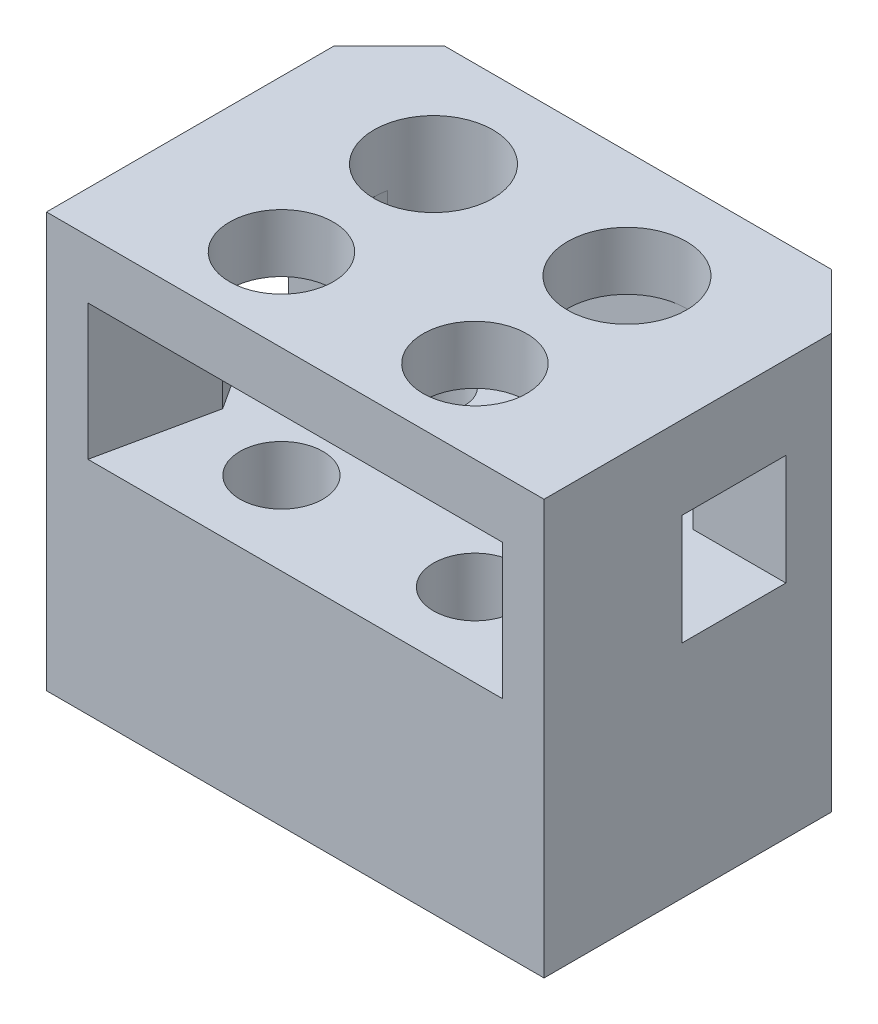
ISO-10303-21;
HEADER;
FILE_DESCRIPTION(('STEP AP214'),'2;1');
FILE_NAME('part.step','',(''),(''),'','','');
FILE_SCHEMA(('AUTOMOTIVE_DESIGN { 1 0 10303 214 1 1 1 1 }'));
ENDSEC;
DATA;
#1=APPLICATION_CONTEXT('core data for automotive mechanical design processes');
#2=APPLICATION_PROTOCOL_DEFINITION('international standard','automotive_design',2000,#1);
#3=PRODUCT_CONTEXT('',#1,'mechanical');
#4=PRODUCT('Part','Part','',(#3));
#5=PRODUCT_RELATED_PRODUCT_CATEGORY('part','',(#4));
#6=PRODUCT_DEFINITION_FORMATION('','',#4);
#7=PRODUCT_DEFINITION_CONTEXT('part definition',#1,'design');
#8=PRODUCT_DEFINITION('design','',#6,#7);
#9=PRODUCT_DEFINITION_SHAPE('','',#8);
#10=(LENGTH_UNIT() NAMED_UNIT(*) SI_UNIT(.MILLI.,.METRE.));
#11=(NAMED_UNIT(*) PLANE_ANGLE_UNIT() SI_UNIT($,.RADIAN.));
#12=(NAMED_UNIT(*) SI_UNIT($,.STERADIAN.) SOLID_ANGLE_UNIT());
#13=UNCERTAINTY_MEASURE_WITH_UNIT(LENGTH_MEASURE(1.E-05),#10,'distance_accuracy_value','');
#14=(GEOMETRIC_REPRESENTATION_CONTEXT(3) GLOBAL_UNCERTAINTY_ASSIGNED_CONTEXT((#13)) GLOBAL_UNIT_ASSIGNED_CONTEXT((#10,
#11,#12)) REPRESENTATION_CONTEXT('',''));
#15=CARTESIAN_POINT('',(0.,0.,0.));
#16=DIRECTION('',(0.,0.,1.));
#17=DIRECTION('',(1.,0.,0.));
#18=AXIS2_PLACEMENT_3D('',#15,#16,#17);
#19=CARTESIAN_POINT('',(-18.,30.,0.));
#20=DIRECTION('',(0.,0.,-1.));
#21=DIRECTION('',(-1.,0.,0.));
#22=AXIS2_PLACEMENT_3D('',#19,#20,#21);
#23=PLANE('',#22);
#24=DIRECTION('',(1.,0.,0.));
#25=VECTOR('',#24,1.);
#26=CARTESIAN_POINT('',(-18.,0.,0.));
#27=LINE('',#26,#25);
#28=CARTESIAN_POINT('',(-18.,0.,0.));
#29=VERTEX_POINT('',#28);
#30=CARTESIAN_POINT('',(18.,0.,0.));
#31=VERTEX_POINT('',#30);
#32=EDGE_CURVE('E416',#29,#31,#27,.T.);
#33=ORIENTED_EDGE('',*,*,#32,.T.);
#34=DIRECTION('',(0.,-1.,0.));
#35=VECTOR('',#34,1.);
#36=CARTESIAN_POINT('',(18.,30.,0.));
#37=LINE('',#36,#35);
#38=CARTESIAN_POINT('',(18.,30.,0.));
#39=VERTEX_POINT('',#38);
#40=EDGE_CURVE('E438',#39,#31,#37,.T.);
#41=ORIENTED_EDGE('',*,*,#40,.F.);
#42=DIRECTION('',(1.,0.,0.));
#43=VECTOR('',#42,1.);
#44=CARTESIAN_POINT('',(-18.,30.,0.));
#45=LINE('',#44,#43);
#46=CARTESIAN_POINT('',(-18.,30.,0.));
#47=VERTEX_POINT('',#46);
#48=EDGE_CURVE('E397',#47,#39,#45,.T.);
#49=ORIENTED_EDGE('',*,*,#48,.F.);
#50=DIRECTION('',(0.,-1.,0.));
#51=VECTOR('',#50,1.);
#52=CARTESIAN_POINT('',(-18.,30.,0.));
#53=LINE('',#52,#51);
#54=EDGE_CURVE('E442',#47,#29,#53,.T.);
#55=ORIENTED_EDGE('',*,*,#54,.T.);
#56=EDGE_LOOP('',(#33,#41,#49,#55));
#57=FACE_BOUND('',#56,.T.);
#58=DIRECTION('',(1.,0.,0.));
#59=VECTOR('',#58,1.);
#60=CARTESIAN_POINT('',(15.,25.8,0.));
#61=LINE('',#60,#59);
#62=CARTESIAN_POINT('',(-15.,25.8,0.));
#63=VERTEX_POINT('',#62);
#64=CARTESIAN_POINT('',(15.,25.8,0.));
#65=VERTEX_POINT('',#64);
#66=EDGE_CURVE('E337',#63,#65,#61,.T.);
#67=ORIENTED_EDGE('',*,*,#66,.T.);
#68=DIRECTION('',(0.,-1.,0.));
#69=VECTOR('',#68,1.);
#70=CARTESIAN_POINT('',(15.,25.8,0.));
#71=LINE('',#70,#69);
#72=CARTESIAN_POINT('',(15.,16.,0.));
#73=VERTEX_POINT('',#72);
#74=EDGE_CURVE('E371',#65,#73,#71,.T.);
#75=ORIENTED_EDGE('',*,*,#74,.T.);
#76=DIRECTION('',(1.,0.,0.));
#77=VECTOR('',#76,1.);
#78=CARTESIAN_POINT('',(15.,16.,0.));
#79=LINE('',#78,#77);
#80=CARTESIAN_POINT('',(-15.,16.,0.));
#81=VERTEX_POINT('',#80);
#82=EDGE_CURVE('E362',#81,#73,#79,.T.);
#83=ORIENTED_EDGE('',*,*,#82,.F.);
#84=DIRECTION('',(0.,-1.,0.));
#85=VECTOR('',#84,1.);
#86=CARTESIAN_POINT('',(-15.,25.8,0.));
#87=LINE('',#86,#85);
#88=EDGE_CURVE('E375',#63,#81,#87,.T.);
#89=ORIENTED_EDGE('',*,*,#88,.F.);
#90=EDGE_LOOP('',(#67,#75,#83,#89));
#91=FACE_BOUND('',#90,.T.);
#92=ADVANCED_FACE('F46',(#57,#91),#23,.F.);
#93=CARTESIAN_POINT('',(-18.,30.,-20.8));
#94=DIRECTION('',(0.707106781186546,0.,0.707106781186549));
#95=DIRECTION('',(0.707106781186549,0.,-0.707106781186546));
#96=AXIS2_PLACEMENT_3D('',#93,#94,#95);
#97=PLANE('',#96);
#98=DIRECTION('',(-0.707106781186548,0.,0.707106781186546));
#99=VECTOR('',#98,1.);
#100=CARTESIAN_POINT('',(-18.,0.,-20.8));
#101=LINE('',#100,#99);
#102=CARTESIAN_POINT('',(-14.,0.,-24.8));
#103=VERTEX_POINT('',#102);
#104=CARTESIAN_POINT('',(-18.,0.,-20.8));
#105=VERTEX_POINT('',#104);
#106=EDGE_CURVE('E388',#103,#105,#101,.T.);
#107=ORIENTED_EDGE('',*,*,#106,.T.);
#108=DIRECTION('',(0.,-1.,0.));
#109=VECTOR('',#108,1.);
#110=CARTESIAN_POINT('',(-18.,30.,-20.8));
#111=LINE('',#110,#109);
#112=CARTESIAN_POINT('',(-18.,30.,-20.8));
#113=VERTEX_POINT('',#112);
#114=EDGE_CURVE('E446',#113,#105,#111,.T.);
#115=ORIENTED_EDGE('',*,*,#114,.F.);
#116=DIRECTION('',(-0.707106781186548,0.,0.707106781186546));
#117=VECTOR('',#116,1.);
#118=CARTESIAN_POINT('',(-18.,30.,-20.8));
#119=LINE('',#118,#117);
#120=CARTESIAN_POINT('',(-14.,30.,-24.8));
#121=VERTEX_POINT('',#120);
#122=EDGE_CURVE('E389',#121,#113,#119,.T.);
#123=ORIENTED_EDGE('',*,*,#122,.F.);
#124=DIRECTION('',(0.,-1.,0.));
#125=VECTOR('',#124,1.);
#126=CARTESIAN_POINT('',(-14.,30.,-24.8));
#127=LINE('',#126,#125);
#128=EDGE_CURVE('E409',#121,#103,#127,.T.);
#129=ORIENTED_EDGE('',*,*,#128,.T.);
#130=EDGE_LOOP('',(#107,#115,#123,#129));
#131=FACE_BOUND('',#130,.T.);
#132=ADVANCED_FACE('F640',(#131),#97,.F.);
#133=CARTESIAN_POINT('',(-18.,30.,0.));
#134=DIRECTION('',(1.,0.,0.));
#135=DIRECTION('',(0.,0.,-1.));
#136=AXIS2_PLACEMENT_3D('',#133,#134,#135);
#137=PLANE('',#136);
#138=DIRECTION('',(0.,0.,1.));
#139=VECTOR('',#138,1.);
#140=CARTESIAN_POINT('',(-18.,24.,-10.));
#141=LINE('',#140,#139);
#142=CARTESIAN_POINT('',(-18.,24.,-17.5));
#143=VERTEX_POINT('',#142);
#144=CARTESIAN_POINT('',(-18.,24.,-10.));
#145=VERTEX_POINT('',#144);
#146=EDGE_CURVE('E273',#143,#145,#141,.T.);
#147=ORIENTED_EDGE('',*,*,#146,.T.);
#148=DIRECTION('',(0.,-1.,0.));
#149=VECTOR('',#148,1.);
#150=CARTESIAN_POINT('',(-18.,24.,-10.));
#151=LINE('',#150,#149);
#152=CARTESIAN_POINT('',(-18.,16.,-10.));
#153=VERTEX_POINT('',#152);
#154=EDGE_CURVE('E258',#145,#153,#151,.T.);
#155=ORIENTED_EDGE('',*,*,#154,.T.);
#156=DIRECTION('',(0.,0.,-1.));
#157=VECTOR('',#156,1.);
#158=CARTESIAN_POINT('',(-18.,16.,-10.));
#159=LINE('',#158,#157);
#160=CARTESIAN_POINT('',(-18.,16.,-17.5));
#161=VERTEX_POINT('',#160);
#162=EDGE_CURVE('E265',#153,#161,#159,.T.);
#163=ORIENTED_EDGE('',*,*,#162,.T.);
#164=DIRECTION('',(0.,1.,0.));
#165=VECTOR('',#164,1.);
#166=CARTESIAN_POINT('',(-18.,24.,-17.5));
#167=LINE('',#166,#165);
#168=EDGE_CURVE('E269',#161,#143,#167,.T.);
#169=ORIENTED_EDGE('',*,*,#168,.T.);
#170=EDGE_LOOP('',(#147,#155,#163,#169));
#171=FACE_BOUND('',#170,.T.);
#172=DIRECTION('',(0.,0.,1.));
#173=VECTOR('',#172,1.);
#174=CARTESIAN_POINT('',(-18.,0.,0.));
#175=LINE('',#174,#173);
#176=EDGE_CURVE('E413',#105,#29,#175,.T.);
#177=ORIENTED_EDGE('',*,*,#176,.T.);
#178=ORIENTED_EDGE('',*,*,#54,.F.);
#179=DIRECTION('',(0.,0.,1.));
#180=VECTOR('',#179,1.);
#181=CARTESIAN_POINT('',(-18.,30.,0.));
#182=LINE('',#181,#180);
#183=EDGE_CURVE('E393',#113,#47,#182,.T.);
#184=ORIENTED_EDGE('',*,*,#183,.F.);
#185=ORIENTED_EDGE('',*,*,#114,.T.);
#186=EDGE_LOOP('',(#177,#178,#184,#185));
#187=FACE_BOUND('',#186,.T.);
#188=ADVANCED_FACE('F607',(#171,#187),#137,.F.);
#189=CARTESIAN_POINT('',(18.,30.,0.));
#190=DIRECTION('',(-1.,0.,0.));
#191=DIRECTION('',(0.,0.,1.));
#192=AXIS2_PLACEMENT_3D('',#189,#190,#191);
#193=PLANE('',#192);
#194=DIRECTION('',(0.,0.,-1.));
#195=VECTOR('',#194,1.);
#196=CARTESIAN_POINT('',(18.,16.,-10.));
#197=LINE('',#196,#195);
#198=CARTESIAN_POINT('',(18.,16.,-10.));
#199=VERTEX_POINT('',#198);
#200=CARTESIAN_POINT('',(18.,16.,-17.5));
#201=VERTEX_POINT('',#200);
#202=EDGE_CURVE('E237',#199,#201,#197,.T.);
#203=ORIENTED_EDGE('',*,*,#202,.F.);
#204=DIRECTION('',(0.,-1.,0.));
#205=VECTOR('',#204,1.);
#206=CARTESIAN_POINT('',(18.,24.,-10.));
#207=LINE('',#206,#205);
#208=CARTESIAN_POINT('',(18.,24.,-10.));
#209=VERTEX_POINT('',#208);
#210=EDGE_CURVE('E247',#209,#199,#207,.T.);
#211=ORIENTED_EDGE('',*,*,#210,.F.);
#212=DIRECTION('',(0.,0.,1.));
#213=VECTOR('',#212,1.);
#214=CARTESIAN_POINT('',(18.,24.,-10.));
#215=LINE('',#214,#213);
#216=CARTESIAN_POINT('',(18.,24.,-17.5));
#217=VERTEX_POINT('',#216);
#218=EDGE_CURVE('E252',#217,#209,#215,.T.);
#219=ORIENTED_EDGE('',*,*,#218,.F.);
#220=DIRECTION('',(0.,1.,0.));
#221=VECTOR('',#220,1.);
#222=CARTESIAN_POINT('',(18.,24.,-17.5));
#223=LINE('',#222,#221);
#224=EDGE_CURVE('E227',#201,#217,#223,.T.);
#225=ORIENTED_EDGE('',*,*,#224,.F.);
#226=EDGE_LOOP('',(#203,#211,#219,#225));
#227=FACE_BOUND('',#226,.T.);
#228=DIRECTION('',(0.,0.,-1.));
#229=VECTOR('',#228,1.);
#230=CARTESIAN_POINT('',(18.,0.,0.));
#231=LINE('',#230,#229);
#232=CARTESIAN_POINT('',(18.,0.,-20.8));
#233=VERTEX_POINT('',#232);
#234=EDGE_CURVE('E419',#31,#233,#231,.T.);
#235=ORIENTED_EDGE('',*,*,#234,.T.);
#236=DIRECTION('',(0.,-1.,0.));
#237=VECTOR('',#236,1.);
#238=CARTESIAN_POINT('',(18.,30.,-20.8));
#239=LINE('',#238,#237);
#240=CARTESIAN_POINT('',(18.,30.,-20.8));
#241=VERTEX_POINT('',#240);
#242=EDGE_CURVE('E434',#241,#233,#239,.T.);
#243=ORIENTED_EDGE('',*,*,#242,.F.);
#244=DIRECTION('',(0.,0.,-1.));
#245=VECTOR('',#244,1.);
#246=CARTESIAN_POINT('',(18.,30.,0.));
#247=LINE('',#246,#245);
#248=EDGE_CURVE('E400',#39,#241,#247,.T.);
#249=ORIENTED_EDGE('',*,*,#248,.F.);
#250=ORIENTED_EDGE('',*,*,#40,.T.);
#251=EDGE_LOOP('',(#235,#243,#249,#250));
#252=FACE_BOUND('',#251,.T.);
#253=ADVANCED_FACE('F249',(#227,#252),#193,.F.);
#254=CARTESIAN_POINT('',(18.,30.,-20.8));
#255=DIRECTION('',(-0.707106781186546,0.,0.707106781186549));
#256=DIRECTION('',(0.707106781186549,0.,0.707106781186546));
#257=AXIS2_PLACEMENT_3D('',#254,#255,#256);
#258=PLANE('',#257);
#259=DIRECTION('',(-0.707106781186548,0.,-0.707106781186546));
#260=VECTOR('',#259,1.);
#261=CARTESIAN_POINT('',(18.,0.,-20.8));
#262=LINE('',#261,#260);
#263=CARTESIAN_POINT('',(14.,0.,-24.8));
#264=VERTEX_POINT('',#263);
#265=EDGE_CURVE('E422',#233,#264,#262,.T.);
#266=ORIENTED_EDGE('',*,*,#265,.T.);
#267=DIRECTION('',(0.,-1.,0.));
#268=VECTOR('',#267,1.);
#269=CARTESIAN_POINT('',(14.,30.,-24.8));
#270=LINE('',#269,#268);
#271=CARTESIAN_POINT('',(14.,30.,-24.8));
#272=VERTEX_POINT('',#271);
#273=EDGE_CURVE('E430',#272,#264,#270,.T.);
#274=ORIENTED_EDGE('',*,*,#273,.F.);
#275=DIRECTION('',(-0.707106781186548,0.,-0.707106781186546));
#276=VECTOR('',#275,1.);
#277=CARTESIAN_POINT('',(18.,30.,-20.8));
#278=LINE('',#277,#276);
#279=EDGE_CURVE('E403',#241,#272,#278,.T.);
#280=ORIENTED_EDGE('',*,*,#279,.F.);
#281=ORIENTED_EDGE('',*,*,#242,.T.);
#282=EDGE_LOOP('',(#266,#274,#280,#281));
#283=FACE_BOUND('',#282,.T.);
#284=ADVANCED_FACE('F716',(#283),#258,.F.);
#285=CARTESIAN_POINT('',(14.,30.,-24.8));
#286=DIRECTION('',(0.,0.,1.));
#287=DIRECTION('',(1.,0.,0.));
#288=AXIS2_PLACEMENT_3D('',#285,#286,#287);
#289=PLANE('',#288);
#290=DIRECTION('',(-1.,0.,0.));
#291=VECTOR('',#290,1.);
#292=CARTESIAN_POINT('',(14.,0.,-24.8));
#293=LINE('',#292,#291);
#294=EDGE_CURVE('E394',#264,#103,#293,.T.);
#295=ORIENTED_EDGE('',*,*,#294,.T.);
#296=ORIENTED_EDGE('',*,*,#128,.F.);
#297=DIRECTION('',(-1.,0.,0.));
#298=VECTOR('',#297,1.);
#299=CARTESIAN_POINT('',(14.,30.,-24.8));
#300=LINE('',#299,#298);
#301=EDGE_CURVE('E406',#272,#121,#300,.T.);
#302=ORIENTED_EDGE('',*,*,#301,.F.);
#303=ORIENTED_EDGE('',*,*,#273,.T.);
#304=EDGE_LOOP('',(#295,#296,#302,#303));
#305=FACE_BOUND('',#304,.T.);
#306=ADVANCED_FACE('F712',(#305),#289,.F.);
#307=CARTESIAN_POINT('',(0.,30.,0.));
#308=DIRECTION('',(0.,1.,0.));
#309=DIRECTION('',(0.,0.,1.));
#310=AXIS2_PLACEMENT_3D('',#307,#308,#309);
#311=PLANE('',#310);
#312=CARTESIAN_POINT('',(-7.,30.,-6.));
#313=DIRECTION('',(0.,1.,0.));
#314=DIRECTION('',(0.,0.,1.));
#315=AXIS2_PLACEMENT_3D('',#312,#313,#314);
#316=CIRCLE('',#315,3.74999999999999);
#317=CARTESIAN_POINT('',(-7.,30.,-2.25000000000001));
#318=VERTEX_POINT('',#317);
#319=EDGE_CURVE('E535',#318,#318,#316,.T.);
#320=ORIENTED_EDGE('',*,*,#319,.F.);
#321=EDGE_LOOP('',(#320));
#322=FACE_BOUND('',#321,.T.);
#323=CARTESIAN_POINT('',(7.,30.,-6.));
#324=DIRECTION('',(0.,1.,0.));
#325=DIRECTION('',(0.,0.,1.));
#326=AXIS2_PLACEMENT_3D('',#323,#324,#325);
#327=CIRCLE('',#326,3.74999999999999);
#328=CARTESIAN_POINT('',(7.,30.,-2.25000000000001));
#329=VERTEX_POINT('',#328);
#330=EDGE_CURVE('E534',#329,#329,#327,.T.);
#331=ORIENTED_EDGE('',*,*,#330,.F.);
#332=EDGE_LOOP('',(#331));
#333=FACE_BOUND('',#332,.T.);
#334=CARTESIAN_POINT('',(-7.,30.,-17.));
#335=DIRECTION('',(0.,1.,0.));
#336=DIRECTION('',(0.,0.,1.));
#337=AXIS2_PLACEMENT_3D('',#334,#335,#336);
#338=CIRCLE('',#337,4.3);
#339=CARTESIAN_POINT('',(-7.,30.,-12.7));
#340=VERTEX_POINT('',#339);
#341=EDGE_CURVE('E309',#340,#340,#338,.T.);
#342=ORIENTED_EDGE('',*,*,#341,.F.);
#343=EDGE_LOOP('',(#342));
#344=FACE_BOUND('',#343,.T.);
#345=CARTESIAN_POINT('',(7.,30.,-17.));
#346=DIRECTION('',(0.,1.,0.));
#347=DIRECTION('',(0.,0.,1.));
#348=AXIS2_PLACEMENT_3D('',#345,#346,#347);
#349=CIRCLE('',#348,4.3);
#350=CARTESIAN_POINT('',(7.,30.,-12.7));
#351=VERTEX_POINT('',#350);
#352=EDGE_CURVE('E320',#351,#351,#349,.T.);
#353=ORIENTED_EDGE('',*,*,#352,.F.);
#354=EDGE_LOOP('',(#353));
#355=FACE_BOUND('',#354,.T.);
#356=ORIENTED_EDGE('',*,*,#122,.T.);
#357=ORIENTED_EDGE('',*,*,#183,.T.);
#358=ORIENTED_EDGE('',*,*,#48,.T.);
#359=ORIENTED_EDGE('',*,*,#248,.T.);
#360=ORIENTED_EDGE('',*,*,#279,.T.);
#361=ORIENTED_EDGE('',*,*,#301,.T.);
#362=EDGE_LOOP('',(#356,#357,#358,#359,#360,#361));
#363=FACE_BOUND('',#362,.T.);
#364=ADVANCED_FACE('F700',(#322,#333,#344,#355,#363),#311,.T.);
#365=CARTESIAN_POINT('',(0.,0.,0.));
#366=DIRECTION('',(0.,1.,0.));
#367=DIRECTION('',(0.,0.,1.));
#368=AXIS2_PLACEMENT_3D('',#365,#366,#367);
#369=PLANE('',#368);
#370=CARTESIAN_POINT('',(-7.,0.,-6.));
#371=DIRECTION('',(0.,1.,0.));
#372=DIRECTION('',(0.,0.,1.));
#373=AXIS2_PLACEMENT_3D('',#370,#371,#372);
#374=CIRCLE('',#373,2.99999999999999);
#375=CARTESIAN_POINT('',(-7.,0.,-3.00000000000001));
#376=VERTEX_POINT('',#375);
#377=EDGE_CURVE('E299',#376,#376,#374,.T.);
#378=ORIENTED_EDGE('',*,*,#377,.T.);
#379=EDGE_LOOP('',(#378));
#380=FACE_BOUND('',#379,.T.);
#381=CARTESIAN_POINT('',(7.,0.,-6.));
#382=DIRECTION('',(0.,1.,0.));
#383=DIRECTION('',(0.,0.,1.));
#384=AXIS2_PLACEMENT_3D('',#381,#382,#383);
#385=CIRCLE('',#384,2.99999999999999);
#386=CARTESIAN_POINT('',(7.,0.,-3.00000000000001));
#387=VERTEX_POINT('',#386);
#388=EDGE_CURVE('E304',#387,#387,#385,.T.);
#389=ORIENTED_EDGE('',*,*,#388,.T.);
#390=EDGE_LOOP('',(#389));
#391=FACE_BOUND('',#390,.T.);
#392=CARTESIAN_POINT('',(-7.,0.,-17.));
#393=DIRECTION('',(0.,1.,0.));
#394=DIRECTION('',(0.,0.,1.));
#395=AXIS2_PLACEMENT_3D('',#392,#393,#394);
#396=CIRCLE('',#395,2.24999999999999);
#397=CARTESIAN_POINT('',(-7.,0.,-14.75));
#398=VERTEX_POINT('',#397);
#399=EDGE_CURVE('E312',#398,#398,#396,.T.);
#400=ORIENTED_EDGE('',*,*,#399,.T.);
#401=EDGE_LOOP('',(#400));
#402=FACE_BOUND('',#401,.T.);
#403=CARTESIAN_POINT('',(7.,0.,-17.));
#404=DIRECTION('',(0.,1.,0.));
#405=DIRECTION('',(0.,0.,1.));
#406=AXIS2_PLACEMENT_3D('',#403,#404,#405);
#407=CIRCLE('',#406,2.24999999999999);
#408=CARTESIAN_POINT('',(7.,0.,-14.75));
#409=VERTEX_POINT('',#408);
#410=EDGE_CURVE('E324',#409,#409,#407,.T.);
#411=ORIENTED_EDGE('',*,*,#410,.T.);
#412=EDGE_LOOP('',(#411));
#413=FACE_BOUND('',#412,.T.);
#414=ORIENTED_EDGE('',*,*,#106,.F.);
#415=ORIENTED_EDGE('',*,*,#294,.F.);
#416=ORIENTED_EDGE('',*,*,#265,.F.);
#417=ORIENTED_EDGE('',*,*,#234,.F.);
#418=ORIENTED_EDGE('',*,*,#32,.F.);
#419=ORIENTED_EDGE('',*,*,#176,.F.);
#420=EDGE_LOOP('',(#414,#415,#416,#417,#418,#419));
#421=FACE_BOUND('',#420,.T.);
#422=ADVANCED_FACE('F697',(#380,#391,#402,#413,#421),#369,.F.);
#423=CARTESIAN_POINT('',(7.,25.8,-17.));
#424=DIRECTION('',(0.,-1.,0.));
#425=DIRECTION('',(0.,0.,-1.));
#426=AXIS2_PLACEMENT_3D('',#423,#424,#425);
#427=CYLINDRICAL_SURFACE('',#426,4.3);
#428=DIRECTION('',(0.,-1.,0.));
#429=VECTOR('',#428,1.);
#430=CARTESIAN_POINT('',(7.,25.8,-21.3));
#431=LINE('',#430,#429);
#432=CARTESIAN_POINT('',(7.,25.8,-21.3));
#433=VERTEX_POINT('',#432);
#434=CARTESIAN_POINT('',(7.,16.,-21.3));
#435=VERTEX_POINT('',#434);
#436=EDGE_CURVE('E385',#433,#435,#431,.T.);
#437=ORIENTED_EDGE('',*,*,#436,.T.);
#438=CARTESIAN_POINT('',(7.,16.,-17.));
#439=DIRECTION('',(0.,1.,0.));
#440=DIRECTION('',(0.,0.,-1.));
#441=AXIS2_PLACEMENT_3D('',#438,#439,#440);
#442=CIRCLE('',#441,4.3);
#443=CARTESIAN_POINT('',(11.2064895830892,16.,-17.8918774508655));
#444=VERTEX_POINT('',#443);
#445=EDGE_CURVE('E346',#444,#435,#442,.T.);
#446=ORIENTED_EDGE('',*,*,#445,.F.);
#447=DIRECTION('',(0.,-1.,0.));
#448=VECTOR('',#447,1.);
#449=CARTESIAN_POINT('',(11.2064895830892,25.8,-17.8918774508655));
#450=LINE('',#449,#448);
#451=CARTESIAN_POINT('',(11.2064895830892,25.8,-17.8918774508655));
#452=VERTEX_POINT('',#451);
#453=EDGE_CURVE('E345',#452,#444,#450,.T.);
#454=ORIENTED_EDGE('',*,*,#453,.F.);
#455=CARTESIAN_POINT('',(7.,25.8,-17.));
#456=DIRECTION('',(0.,-1.,0.));
#457=DIRECTION('',(0.,0.,-1.));
#458=AXIS2_PLACEMENT_3D('',#455,#456,#457);
#459=CIRCLE('',#458,4.3);
#460=EDGE_CURVE('E450',#452,#433,#459,.T.);
#461=ORIENTED_EDGE('',*,*,#460,.T.);
#462=EDGE_LOOP('',(#437,#446,#454,#461));
#463=FACE_BOUND('',#462,.T.);
#464=ORIENTED_EDGE('',*,*,#352,.T.);
#465=EDGE_LOOP('',(#464));
#466=FACE_BOUND('',#465,.T.);
#467=ADVANCED_FACE('F581',(#463,#466),#427,.F.);
#468=CARTESIAN_POINT('',(-7.,25.8,-21.3));
#469=DIRECTION('',(0.,0.,1.));
#470=DIRECTION('',(1.,0.,0.));
#471=AXIS2_PLACEMENT_3D('',#468,#469,#470);
#472=PLANE('',#471);
#473=DIRECTION('',(-1.,0.,0.));
#474=VECTOR('',#473,1.);
#475=CARTESIAN_POINT('',(-7.,16.,-21.3));
#476=LINE('',#475,#474);
#477=CARTESIAN_POINT('',(-7.,16.,-21.3));
#478=VERTEX_POINT('',#477);
#479=EDGE_CURVE('E350',#435,#478,#476,.T.);
#480=ORIENTED_EDGE('',*,*,#479,.F.);
#481=ORIENTED_EDGE('',*,*,#436,.F.);
#482=DIRECTION('',(-1.,0.,0.));
#483=VECTOR('',#482,1.);
#484=CARTESIAN_POINT('',(-7.,25.8,-21.3));
#485=LINE('',#484,#483);
#486=CARTESIAN_POINT('',(-7.,25.8,-21.3));
#487=VERTEX_POINT('',#486);
#488=EDGE_CURVE('E329',#433,#487,#485,.T.);
#489=ORIENTED_EDGE('',*,*,#488,.T.);
#490=DIRECTION('',(0.,-1.,0.));
#491=VECTOR('',#490,1.);
#492=CARTESIAN_POINT('',(-7.,25.8,-21.3));
#493=LINE('',#492,#491);
#494=EDGE_CURVE('E382',#487,#478,#493,.T.);
#495=ORIENTED_EDGE('',*,*,#494,.T.);
#496=EDGE_LOOP('',(#480,#481,#489,#495));
#497=FACE_BOUND('',#496,.T.);
#498=ADVANCED_FACE('F586',(#497),#472,.T.);
#499=CARTESIAN_POINT('',(-7.,25.8,-17.));
#500=DIRECTION('',(0.,-1.,0.));
#501=DIRECTION('',(0.,0.,-1.));
#502=AXIS2_PLACEMENT_3D('',#499,#500,#501);
#503=CYLINDRICAL_SURFACE('',#502,4.3);
#504=DIRECTION('',(0.,-1.,0.));
#505=VECTOR('',#504,1.);
#506=CARTESIAN_POINT('',(-11.2064895830892,25.8,-17.8918774508655));
#507=LINE('',#506,#505);
#508=CARTESIAN_POINT('',(-11.2064895830892,25.8,-17.8918774508655));
#509=VERTEX_POINT('',#508);
#510=CARTESIAN_POINT('',(-11.2064895830892,16.,-17.8918774508655));
#511=VERTEX_POINT('',#510);
#512=EDGE_CURVE('E379',#509,#511,#507,.T.);
#513=ORIENTED_EDGE('',*,*,#512,.T.);
#514=CARTESIAN_POINT('',(-7.,16.,-17.));
#515=DIRECTION('',(0.,1.,0.));
#516=DIRECTION('',(0.,0.,1.));
#517=AXIS2_PLACEMENT_3D('',#514,#515,#516);
#518=CIRCLE('',#517,4.3);
#519=EDGE_CURVE('E354',#478,#511,#518,.T.);
#520=ORIENTED_EDGE('',*,*,#519,.F.);
#521=ORIENTED_EDGE('',*,*,#494,.F.);
#522=CARTESIAN_POINT('',(-7.,25.8,-17.));
#523=DIRECTION('',(0.,-1.,0.));
#524=DIRECTION('',(0.,0.,-1.));
#525=AXIS2_PLACEMENT_3D('',#522,#523,#524);
#526=CIRCLE('',#525,4.3);
#527=EDGE_CURVE('E317',#487,#509,#526,.T.);
#528=ORIENTED_EDGE('',*,*,#527,.T.);
#529=EDGE_LOOP('',(#513,#520,#521,#528));
#530=FACE_BOUND('',#529,.T.);
#531=ORIENTED_EDGE('',*,*,#341,.T.);
#532=EDGE_LOOP('',(#531));
#533=FACE_BOUND('',#532,.T.);
#534=ADVANCED_FACE('F589',(#530,#533),#503,.F.);
#535=CARTESIAN_POINT('',(-11.2064895830892,25.8,-17.8918774508655));
#536=DIRECTION('',(0.978253391416086,0.,0.207413360666393));
#537=DIRECTION('',(0.207413360666393,0.,-0.978253391416085));
#538=AXIS2_PLACEMENT_3D('',#535,#536,#537);
#539=PLANE('',#538);
#540=DIRECTION('',(-0.207413360666393,0.,0.978253391416085));
#541=VECTOR('',#540,1.);
#542=CARTESIAN_POINT('',(-11.2064895830892,16.,-17.8918774508655));
#543=LINE('',#542,#541);
#544=CARTESIAN_POINT('',(-13.2945850489155,16.,-8.04349321716783));
#545=VERTEX_POINT('',#544);
#546=EDGE_CURVE('E358',#545,#81,#543,.T.);
#547=ORIENTED_EDGE('',*,*,#546,.F.);
#548=DIRECTION('',(0.,1.,0.));
#549=VECTOR('',#548,1.);
#550=CARTESIAN_POINT('',(-13.2945850489155,24.,-8.04349321716783));
#551=LINE('',#550,#549);
#552=CARTESIAN_POINT('',(-13.2945850489155,24.,-8.04349321716783));
#553=VERTEX_POINT('',#552);
#554=EDGE_CURVE('E471',#545,#553,#551,.T.);
#555=ORIENTED_EDGE('',*,*,#554,.T.);
#556=DIRECTION('',(-0.207413360666393,0.,0.978253391416085));
#557=VECTOR('',#556,1.);
#558=CARTESIAN_POINT('',(-11.2064895830892,24.,-17.8918774508655));
#559=LINE('',#558,#557);
#560=CARTESIAN_POINT('',(-11.2895770732697,24.,-17.5));
#561=VERTEX_POINT('',#560);
#562=EDGE_CURVE('E296',#561,#553,#559,.T.);
#563=ORIENTED_EDGE('',*,*,#562,.F.);
#564=DIRECTION('',(0.,1.,0.));
#565=VECTOR('',#564,1.);
#566=CARTESIAN_POINT('',(-11.2895770732697,25.8,-17.5));
#567=LINE('',#566,#565);
#568=CARTESIAN_POINT('',(-11.2895770732697,16.,-17.5));
#569=VERTEX_POINT('',#568);
#570=EDGE_CURVE('E293',#569,#561,#567,.T.);
#571=ORIENTED_EDGE('',*,*,#570,.F.);
#572=EDGE_CURVE('E359',#511,#569,#543,.T.);
#573=ORIENTED_EDGE('',*,*,#572,.F.);
#574=ORIENTED_EDGE('',*,*,#512,.F.);
#575=DIRECTION('',(-0.207413360666393,0.,0.978253391416085));
#576=VECTOR('',#575,1.);
#577=CARTESIAN_POINT('',(-11.2064895830892,25.8,-17.8918774508655));
#578=LINE('',#577,#576);
#579=EDGE_CURVE('E333',#509,#63,#578,.T.);
#580=ORIENTED_EDGE('',*,*,#579,.T.);
#581=ORIENTED_EDGE('',*,*,#88,.T.);
#582=EDGE_LOOP('',(#547,#555,#563,#571,#573,#574,#580,#581));
#583=FACE_BOUND('',#582,.T.);
#584=ADVANCED_FACE('F597',(#583),#539,.T.);
#585=CARTESIAN_POINT('',(11.2064895830892,25.8,-17.8918774508655));
#586=DIRECTION('',(-0.978253391416086,0.,0.207413360666393));
#587=DIRECTION('',(0.207413360666393,0.,0.978253391416085));
#588=AXIS2_PLACEMENT_3D('',#585,#586,#587);
#589=PLANE('',#588);
#590=DIRECTION('',(-0.207413360666393,0.,-0.978253391416085));
#591=VECTOR('',#590,1.);
#592=CARTESIAN_POINT('',(11.2064895830892,24.,-17.8918774508655));
#593=LINE('',#592,#591);
#594=CARTESIAN_POINT('',(13.2945850489155,24.,-8.04349321716783));
#595=VERTEX_POINT('',#594);
#596=CARTESIAN_POINT('',(11.2895770732697,24.,-17.5));
#597=VERTEX_POINT('',#596);
#598=EDGE_CURVE('E67',#595,#597,#593,.T.);
#599=ORIENTED_EDGE('',*,*,#598,.F.);
#600=DIRECTION('',(0.,-1.,0.));
#601=VECTOR('',#600,1.);
#602=CARTESIAN_POINT('',(13.2945850489155,16.,-8.04349321716783));
#603=LINE('',#602,#601);
#604=CARTESIAN_POINT('',(13.2945850489155,16.,-8.04349321716783));
#605=VERTEX_POINT('',#604);
#606=EDGE_CURVE('E75',#595,#605,#603,.T.);
#607=ORIENTED_EDGE('',*,*,#606,.T.);
#608=DIRECTION('',(-0.207413360666393,0.,-0.978253391416085));
#609=VECTOR('',#608,1.);
#610=CARTESIAN_POINT('',(11.2064895830892,16.,-17.8918774508655));
#611=LINE('',#610,#609);
#612=EDGE_CURVE('E334',#73,#605,#611,.T.);
#613=ORIENTED_EDGE('',*,*,#612,.F.);
#614=ORIENTED_EDGE('',*,*,#74,.F.);
#615=DIRECTION('',(-0.207413360666393,0.,-0.978253391416085));
#616=VECTOR('',#615,1.);
#617=CARTESIAN_POINT('',(11.2064895830892,25.8,-17.8918774508655));
#618=LINE('',#617,#616);
#619=EDGE_CURVE('E341',#65,#452,#618,.T.);
#620=ORIENTED_EDGE('',*,*,#619,.T.);
#621=ORIENTED_EDGE('',*,*,#453,.T.);
#622=CARTESIAN_POINT('',(11.2895770732697,16.,-17.5));
#623=VERTEX_POINT('',#622);
#624=EDGE_CURVE('E365',#623,#444,#611,.T.);
#625=ORIENTED_EDGE('',*,*,#624,.F.);
#626=DIRECTION('',(0.,-1.,0.));
#627=VECTOR('',#626,1.);
#628=CARTESIAN_POINT('',(11.2895770732697,25.8,-17.5));
#629=LINE('',#628,#627);
#630=EDGE_CURVE('E229',#597,#623,#629,.T.);
#631=ORIENTED_EDGE('',*,*,#630,.F.);
#632=EDGE_LOOP('',(#599,#607,#613,#614,#620,#621,#625,#631));
#633=FACE_BOUND('',#632,.T.);
#634=ADVANCED_FACE('F575',(#633),#589,.T.);
#635=CARTESIAN_POINT('',(7.,25.8,-17.));
#636=DIRECTION('',(0.,-1.,0.));
#637=DIRECTION('',(0.,0.,-1.));
#638=AXIS2_PLACEMENT_3D('',#635,#636,#637);
#639=PLANE('',#638);
#640=CARTESIAN_POINT('',(-7.,25.8,-6.));
#641=DIRECTION('',(0.,-1.,0.));
#642=DIRECTION('',(0.,0.,-1.));
#643=AXIS2_PLACEMENT_3D('',#640,#641,#642);
#644=CIRCLE('',#643,3.74999999999999);
#645=CARTESIAN_POINT('',(-7.,25.8,-9.74999999999999));
#646=VERTEX_POINT('',#645);
#647=EDGE_CURVE('E51',#646,#646,#644,.T.);
#648=ORIENTED_EDGE('',*,*,#647,.F.);
#649=EDGE_LOOP('',(#648));
#650=FACE_BOUND('',#649,.T.);
#651=CARTESIAN_POINT('',(7.,25.8,-6.));
#652=DIRECTION('',(0.,-1.,0.));
#653=DIRECTION('',(0.,0.,-1.));
#654=AXIS2_PLACEMENT_3D('',#651,#652,#653);
#655=CIRCLE('',#654,3.74999999999999);
#656=CARTESIAN_POINT('',(7.,25.8,-9.74999999999999));
#657=VERTEX_POINT('',#656);
#658=EDGE_CURVE('E507',#657,#657,#655,.T.);
#659=ORIENTED_EDGE('',*,*,#658,.F.);
#660=EDGE_LOOP('',(#659));
#661=FACE_BOUND('',#660,.T.);
#662=ORIENTED_EDGE('',*,*,#527,.F.);
#663=ORIENTED_EDGE('',*,*,#488,.F.);
#664=ORIENTED_EDGE('',*,*,#460,.F.);
#665=ORIENTED_EDGE('',*,*,#619,.F.);
#666=ORIENTED_EDGE('',*,*,#66,.F.);
#667=ORIENTED_EDGE('',*,*,#579,.F.);
#668=EDGE_LOOP('',(#662,#663,#664,#665,#666,#667));
#669=FACE_BOUND('',#668,.T.);
#670=ADVANCED_FACE('F623',(#650,#661,#669),#639,.T.);
#671=CARTESIAN_POINT('',(7.,16.,-17.));
#672=DIRECTION('',(0.,-1.,0.));
#673=DIRECTION('',(0.,0.,-1.));
#674=AXIS2_PLACEMENT_3D('',#671,#672,#673);
#675=PLANE('',#674);
#676=CARTESIAN_POINT('',(-7.,16.,-17.));
#677=DIRECTION('',(0.,-1.,0.));
#678=DIRECTION('',(0.,0.,-1.));
#679=AXIS2_PLACEMENT_3D('',#676,#677,#678);
#680=CIRCLE('',#679,2.25);
#681=CARTESIAN_POINT('',(-7.,16.,-19.25));
#682=VERTEX_POINT('',#681);
#683=EDGE_CURVE('E316',#682,#682,#680,.T.);
#684=ORIENTED_EDGE('',*,*,#683,.T.);
#685=EDGE_LOOP('',(#684));
#686=FACE_BOUND('',#685,.T.);
#687=CARTESIAN_POINT('',(7.,16.,-17.));
#688=DIRECTION('',(0.,-1.,0.));
#689=DIRECTION('',(0.,0.,-1.));
#690=AXIS2_PLACEMENT_3D('',#687,#688,#689);
#691=CIRCLE('',#690,2.25);
#692=CARTESIAN_POINT('',(7.,16.,-19.25));
#693=VERTEX_POINT('',#692);
#694=EDGE_CURVE('E328',#693,#693,#691,.T.);
#695=ORIENTED_EDGE('',*,*,#694,.T.);
#696=EDGE_LOOP('',(#695));
#697=FACE_BOUND('',#696,.T.);
#698=ORIENTED_EDGE('',*,*,#572,.T.);
#699=DIRECTION('',(1.,0.,0.));
#700=VECTOR('',#699,1.);
#701=CARTESIAN_POINT('',(-18.,16.,-17.5));
#702=LINE('',#701,#700);
#703=EDGE_CURVE('E233',#161,#569,#702,.T.);
#704=ORIENTED_EDGE('',*,*,#703,.F.);
#705=ORIENTED_EDGE('',*,*,#162,.F.);
#706=DIRECTION('',(1.,0.,0.));
#707=VECTOR('',#706,1.);
#708=CARTESIAN_POINT('',(-18.,16.,-10.));
#709=LINE('',#708,#707);
#710=CARTESIAN_POINT('',(-14.5665729375794,16.,-10.));
#711=VERTEX_POINT('',#710);
#712=EDGE_CURVE('E234',#153,#711,#709,.T.);
#713=ORIENTED_EDGE('',*,*,#712,.T.);
#714=DIRECTION('',(0.545066212953153,0.,0.83839300062495));
#715=VECTOR('',#714,1.);
#716=CARTESIAN_POINT('',(-11.358062895696,16.,-5.0648337805135));
#717=LINE('',#716,#715);
#718=EDGE_CURVE('E481',#711,#545,#717,.T.);
#719=ORIENTED_EDGE('',*,*,#718,.T.);
#720=ORIENTED_EDGE('',*,*,#546,.T.);
#721=ORIENTED_EDGE('',*,*,#82,.T.);
#722=ORIENTED_EDGE('',*,*,#612,.T.);
#723=DIRECTION('',(0.545066212953154,0.,-0.83839300062495));
#724=VECTOR('',#723,1.);
#725=CARTESIAN_POINT('',(15.5174233667393,16.,-11.4625495499525));
#726=LINE('',#725,#724);
#727=CARTESIAN_POINT('',(14.5665729375794,16.,-10.));
#728=VERTEX_POINT('',#727);
#729=EDGE_CURVE('E11',#605,#728,#726,.T.);
#730=ORIENTED_EDGE('',*,*,#729,.T.);
#731=EDGE_CURVE('E242',#728,#199,#709,.T.);
#732=ORIENTED_EDGE('',*,*,#731,.T.);
#733=ORIENTED_EDGE('',*,*,#202,.T.);
#734=EDGE_CURVE('E222',#623,#201,#702,.T.);
#735=ORIENTED_EDGE('',*,*,#734,.F.);
#736=ORIENTED_EDGE('',*,*,#624,.T.);
#737=ORIENTED_EDGE('',*,*,#445,.T.);
#738=ORIENTED_EDGE('',*,*,#479,.T.);
#739=ORIENTED_EDGE('',*,*,#519,.T.);
#740=EDGE_LOOP('',(#698,#704,#705,#713,#719,#720,#721,#722,#730,#732,#733,#735,#736,#737,#738,#739));
#741=FACE_BOUND('',#740,.T.);
#742=CARTESIAN_POINT('',(7.,16.,-6.));
#743=DIRECTION('',(0.,-1.,0.));
#744=DIRECTION('',(0.,0.,-1.));
#745=AXIS2_PLACEMENT_3D('',#742,#743,#744);
#746=CIRCLE('',#745,3.);
#747=CARTESIAN_POINT('',(7.,16.,-9.));
#748=VERTEX_POINT('',#747);
#749=EDGE_CURVE('E308',#748,#748,#746,.T.);
#750=ORIENTED_EDGE('',*,*,#749,.T.);
#751=EDGE_LOOP('',(#750));
#752=FACE_BOUND('',#751,.T.);
#753=CARTESIAN_POINT('',(-7.,16.,-6.));
#754=DIRECTION('',(0.,-1.,0.));
#755=DIRECTION('',(0.,0.,-1.));
#756=AXIS2_PLACEMENT_3D('',#753,#754,#755);
#757=CIRCLE('',#756,3.);
#758=CARTESIAN_POINT('',(-7.,16.,-9.));
#759=VERTEX_POINT('',#758);
#760=EDGE_CURVE('E303',#759,#759,#757,.T.);
#761=ORIENTED_EDGE('',*,*,#760,.T.);
#762=EDGE_LOOP('',(#761));
#763=FACE_BOUND('',#762,.T.);
#764=ADVANCED_FACE('F239',(#686,#697,#741,#752,#763),#675,.F.);
#765=CARTESIAN_POINT('',(7.,30.,-17.));
#766=DIRECTION('',(0.,1.,0.));
#767=DIRECTION('',(0.,0.,1.));
#768=AXIS2_PLACEMENT_3D('',#765,#766,#767);
#769=CYLINDRICAL_SURFACE('',#768,2.25);
#770=ORIENTED_EDGE('',*,*,#410,.F.);
#771=EDGE_LOOP('',(#770));
#772=FACE_BOUND('',#771,.T.);
#773=ORIENTED_EDGE('',*,*,#694,.F.);
#774=EDGE_LOOP('',(#773));
#775=FACE_BOUND('',#774,.T.);
#776=ADVANCED_FACE('F632',(#772,#775),#769,.F.);
#777=CARTESIAN_POINT('',(-7.,30.,-17.));
#778=DIRECTION('',(0.,1.,0.));
#779=DIRECTION('',(0.,0.,1.));
#780=AXIS2_PLACEMENT_3D('',#777,#778,#779);
#781=CYLINDRICAL_SURFACE('',#780,2.25);
#782=ORIENTED_EDGE('',*,*,#399,.F.);
#783=EDGE_LOOP('',(#782));
#784=FACE_BOUND('',#783,.T.);
#785=ORIENTED_EDGE('',*,*,#683,.F.);
#786=EDGE_LOOP('',(#785));
#787=FACE_BOUND('',#786,.T.);
#788=ADVANCED_FACE('F680',(#784,#787),#781,.F.);
#789=CARTESIAN_POINT('',(7.,30.,-6.));
#790=DIRECTION('',(0.,1.,0.));
#791=DIRECTION('',(0.,0.,1.));
#792=AXIS2_PLACEMENT_3D('',#789,#790,#791);
#793=CYLINDRICAL_SURFACE('',#792,3.);
#794=ORIENTED_EDGE('',*,*,#388,.F.);
#795=EDGE_LOOP('',(#794));
#796=FACE_BOUND('',#795,.T.);
#797=ORIENTED_EDGE('',*,*,#749,.F.);
#798=EDGE_LOOP('',(#797));
#799=FACE_BOUND('',#798,.T.);
#800=ADVANCED_FACE('F673',(#796,#799),#793,.F.);
#801=CARTESIAN_POINT('',(-7.,30.,-6.));
#802=DIRECTION('',(0.,1.,0.));
#803=DIRECTION('',(0.,0.,1.));
#804=AXIS2_PLACEMENT_3D('',#801,#802,#803);
#805=CYLINDRICAL_SURFACE('',#804,3.);
#806=ORIENTED_EDGE('',*,*,#377,.F.);
#807=EDGE_LOOP('',(#806));
#808=FACE_BOUND('',#807,.T.);
#809=ORIENTED_EDGE('',*,*,#760,.F.);
#810=EDGE_LOOP('',(#809));
#811=FACE_BOUND('',#810,.T.);
#812=ADVANCED_FACE('F668',(#808,#811),#805,.F.);
#813=CARTESIAN_POINT('',(-18.,24.,-17.5));
#814=DIRECTION('',(0.,0.,-1.));
#815=DIRECTION('',(-1.,0.,0.));
#816=AXIS2_PLACEMENT_3D('',#813,#814,#815);
#817=PLANE('',#816);
#818=ORIENTED_EDGE('',*,*,#630,.T.);
#819=ORIENTED_EDGE('',*,*,#734,.T.);
#820=ORIENTED_EDGE('',*,*,#224,.T.);
#821=DIRECTION('',(1.,0.,0.));
#822=VECTOR('',#821,1.);
#823=CARTESIAN_POINT('',(-18.,24.,-17.5));
#824=LINE('',#823,#822);
#825=EDGE_CURVE('E285',#597,#217,#824,.T.);
#826=ORIENTED_EDGE('',*,*,#825,.F.);
#827=EDGE_LOOP('',(#818,#819,#820,#826));
#828=FACE_BOUND('',#827,.T.);
#829=ADVANCED_FACE('F224',(#828),#817,.F.);
#830=CARTESIAN_POINT('',(-18.,24.,-10.));
#831=DIRECTION('',(0.,1.,0.));
#832=DIRECTION('',(0.,0.,1.));
#833=AXIS2_PLACEMENT_3D('',#830,#831,#832);
#834=PLANE('',#833);
#835=ORIENTED_EDGE('',*,*,#598,.T.);
#836=ORIENTED_EDGE('',*,*,#825,.T.);
#837=ORIENTED_EDGE('',*,*,#218,.T.);
#838=DIRECTION('',(1.,0.,0.));
#839=VECTOR('',#838,1.);
#840=CARTESIAN_POINT('',(-18.,24.,-10.));
#841=LINE('',#840,#839);
#842=CARTESIAN_POINT('',(14.5665729375794,24.,-10.));
#843=VERTEX_POINT('',#842);
#844=EDGE_CURVE('E281',#843,#209,#841,.T.);
#845=ORIENTED_EDGE('',*,*,#844,.F.);
#846=DIRECTION('',(-0.545066212953154,0.,0.83839300062495));
#847=VECTOR('',#846,1.);
#848=CARTESIAN_POINT('',(4.89113606944248,24.,4.88226265995268));
#849=LINE('',#848,#847);
#850=EDGE_CURVE('E57',#843,#595,#849,.T.);
#851=ORIENTED_EDGE('',*,*,#850,.T.);
#852=EDGE_LOOP('',(#835,#836,#837,#845,#851));
#853=FACE_BOUND('',#852,.T.);
#854=ADVANCED_FACE('F492',(#853),#834,.F.);
#855=CARTESIAN_POINT('',(-18.,24.,-10.));
#856=DIRECTION('',(0.,0.,1.));
#857=DIRECTION('',(1.,0.,0.));
#858=AXIS2_PLACEMENT_3D('',#855,#856,#857);
#859=PLANE('',#858);
#860=ORIENTED_EDGE('',*,*,#731,.F.);
#861=DIRECTION('',(0.,1.,0.));
#862=VECTOR('',#861,1.);
#863=CARTESIAN_POINT('',(14.5665729375794,24.,-10.));
#864=LINE('',#863,#862);
#865=EDGE_CURVE('E475',#728,#843,#864,.T.);
#866=ORIENTED_EDGE('',*,*,#865,.T.);
#867=ORIENTED_EDGE('',*,*,#844,.T.);
#868=ORIENTED_EDGE('',*,*,#210,.T.);
#869=EDGE_LOOP('',(#860,#866,#867,#868));
#870=FACE_BOUND('',#869,.T.);
#871=ADVANCED_FACE('F497',(#870),#859,.F.);
#872=ORIENTED_EDGE('',*,*,#562,.T.);
#873=DIRECTION('',(-0.545066212953153,0.,-0.83839300062495));
#874=VECTOR('',#873,1.);
#875=CARTESIAN_POINT('',(-15.5866344235538,24.,-11.5690064614619));
#876=LINE('',#875,#874);
#877=CARTESIAN_POINT('',(-14.5665729375794,24.,-10.));
#878=VERTEX_POINT('',#877);
#879=EDGE_CURVE('E484',#553,#878,#876,.T.);
#880=ORIENTED_EDGE('',*,*,#879,.T.);
#881=EDGE_CURVE('E277',#145,#878,#841,.T.);
#882=ORIENTED_EDGE('',*,*,#881,.F.);
#883=ORIENTED_EDGE('',*,*,#146,.F.);
#884=EDGE_CURVE('E282',#143,#561,#824,.T.);
#885=ORIENTED_EDGE('',*,*,#884,.T.);
#886=EDGE_LOOP('',(#872,#880,#882,#883,#885));
#887=FACE_BOUND('',#886,.T.);
#888=ADVANCED_FACE('F604',(#887),#834,.F.);
#889=ORIENTED_EDGE('',*,*,#881,.T.);
#890=DIRECTION('',(0.,-1.,0.));
#891=VECTOR('',#890,1.);
#892=CARTESIAN_POINT('',(-14.5665729375794,16.,-10.));
#893=LINE('',#892,#891);
#894=EDGE_CURVE('E467',#878,#711,#893,.T.);
#895=ORIENTED_EDGE('',*,*,#894,.T.);
#896=ORIENTED_EDGE('',*,*,#712,.F.);
#897=ORIENTED_EDGE('',*,*,#154,.F.);
#898=EDGE_LOOP('',(#889,#895,#896,#897));
#899=FACE_BOUND('',#898,.T.);
#900=ADVANCED_FACE('F611',(#899),#859,.F.);
#901=ORIENTED_EDGE('',*,*,#570,.T.);
#902=ORIENTED_EDGE('',*,*,#884,.F.);
#903=ORIENTED_EDGE('',*,*,#168,.F.);
#904=ORIENTED_EDGE('',*,*,#703,.T.);
#905=EDGE_LOOP('',(#901,#902,#903,#904));
#906=FACE_BOUND('',#905,.T.);
#907=ADVANCED_FACE('F601',(#906),#817,.F.);
#908=CARTESIAN_POINT('',(-14.5665729375794,24.,-10.));
#909=DIRECTION('',(0.83839300062495,0.,-0.545066212953153));
#910=DIRECTION('',(0.,1.,0.));
#911=AXIS2_PLACEMENT_3D('',#908,#909,#910);
#912=PLANE('',#911);
#913=ORIENTED_EDGE('',*,*,#879,.F.);
#914=ORIENTED_EDGE('',*,*,#554,.F.);
#915=ORIENTED_EDGE('',*,*,#718,.F.);
#916=ORIENTED_EDGE('',*,*,#894,.F.);
#917=EDGE_LOOP('',(#913,#914,#915,#916));
#918=FACE_BOUND('',#917,.T.);
#919=ADVANCED_FACE('F615',(#918),#912,.T.);
#920=CARTESIAN_POINT('',(14.5665729375794,24.,-10.));
#921=DIRECTION('',(-0.83839300062495,0.,-0.545066212953154));
#922=DIRECTION('',(0.,-1.,0.));
#923=AXIS2_PLACEMENT_3D('',#920,#921,#922);
#924=PLANE('',#923);
#925=ORIENTED_EDGE('',*,*,#729,.F.);
#926=ORIENTED_EDGE('',*,*,#606,.F.);
#927=ORIENTED_EDGE('',*,*,#850,.F.);
#928=ORIENTED_EDGE('',*,*,#865,.F.);
#929=EDGE_LOOP('',(#925,#926,#927,#928));
#930=FACE_BOUND('',#929,.T.);
#931=ADVANCED_FACE('F49',(#930),#924,.T.);
#932=CARTESIAN_POINT('',(7.,30.,-6.));
#933=DIRECTION('',(0.,1.,0.));
#934=DIRECTION('',(0.,0.,1.));
#935=AXIS2_PLACEMENT_3D('',#932,#933,#934);
#936=CYLINDRICAL_SURFACE('',#935,3.74999999999999);
#937=ORIENTED_EDGE('',*,*,#658,.T.);
#938=EDGE_LOOP('',(#937));
#939=FACE_BOUND('',#938,.T.);
#940=ORIENTED_EDGE('',*,*,#330,.T.);
#941=EDGE_LOOP('',(#940));
#942=FACE_BOUND('',#941,.T.);
#943=ADVANCED_FACE('F660',(#939,#942),#936,.F.);
#944=CARTESIAN_POINT('',(-7.,30.,-6.));
#945=DIRECTION('',(0.,1.,0.));
#946=DIRECTION('',(0.,0.,1.));
#947=AXIS2_PLACEMENT_3D('',#944,#945,#946);
#948=CYLINDRICAL_SURFACE('',#947,3.74999999999999);
#949=ORIENTED_EDGE('',*,*,#647,.T.);
#950=EDGE_LOOP('',(#949));
#951=FACE_BOUND('',#950,.T.);
#952=ORIENTED_EDGE('',*,*,#319,.T.);
#953=EDGE_LOOP('',(#952));
#954=FACE_BOUND('',#953,.T.);
#955=ADVANCED_FACE('F811',(#951,#954),#948,.F.);
#956=CLOSED_SHELL('',(#92,#132,#188,#253,#284,#306,#364,#422,#467,#498,#534,#584,#634,#670,#764,
#776,#788,#800,#812,#829,#854,#871,#888,#900,#907,#919,#931,#943,#955));
#957=MANIFOLD_SOLID_BREP('B2',#956);
#958=ADVANCED_BREP_SHAPE_REPRESENTATION('',(#18,#957),#14);
#959=SHAPE_DEFINITION_REPRESENTATION(#9,#958);
ENDSEC;
END-ISO-10303-21;
